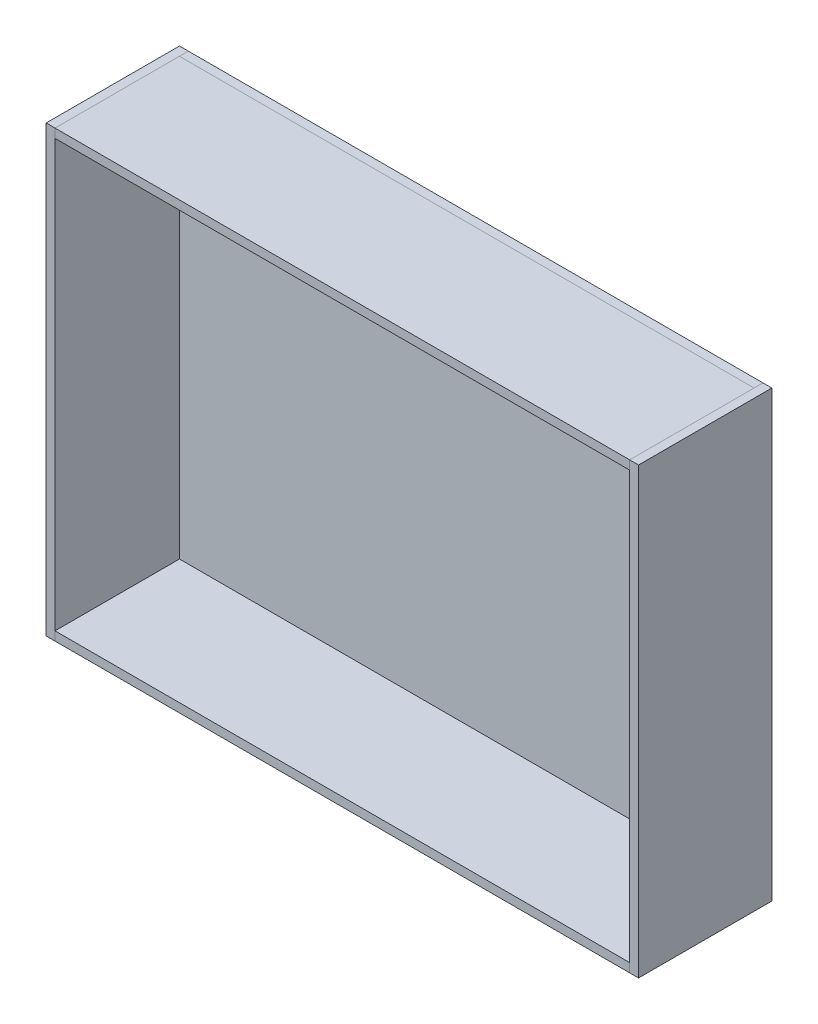
ISO-10303-21;
HEADER;
FILE_DESCRIPTION(('STEP AP214'),'2;1');
FILE_NAME('part.step','',(''),(''),'','','');
FILE_SCHEMA(('AUTOMOTIVE_DESIGN { 1 0 10303 214 1 1 1 1 }'));
ENDSEC;
DATA;
#1=APPLICATION_CONTEXT('core data for automotive mechanical design processes');
#2=APPLICATION_PROTOCOL_DEFINITION('international standard','automotive_design',2000,#1);
#3=PRODUCT_CONTEXT('',#1,'mechanical');
#4=PRODUCT('Part','Part','',(#3));
#5=PRODUCT_RELATED_PRODUCT_CATEGORY('part','',(#4));
#6=PRODUCT_DEFINITION_FORMATION('','',#4);
#7=PRODUCT_DEFINITION_CONTEXT('part definition',#1,'design');
#8=PRODUCT_DEFINITION('design','',#6,#7);
#9=PRODUCT_DEFINITION_SHAPE('','',#8);
#10=(LENGTH_UNIT() NAMED_UNIT(*) SI_UNIT(.MILLI.,.METRE.));
#11=(NAMED_UNIT(*) PLANE_ANGLE_UNIT() SI_UNIT($,.RADIAN.));
#12=(NAMED_UNIT(*) SI_UNIT($,.STERADIAN.) SOLID_ANGLE_UNIT());
#13=UNCERTAINTY_MEASURE_WITH_UNIT(LENGTH_MEASURE(1.E-05),#10,'distance_accuracy_value','');
#14=(GEOMETRIC_REPRESENTATION_CONTEXT(3) GLOBAL_UNCERTAINTY_ASSIGNED_CONTEXT((#13)) GLOBAL_UNIT_ASSIGNED_CONTEXT((#10,
#11,#12)) REPRESENTATION_CONTEXT('',''));
#15=CARTESIAN_POINT('',(0.,0.,0.));
#16=DIRECTION('',(0.,0.,1.));
#17=DIRECTION('',(1.,0.,0.));
#18=AXIS2_PLACEMENT_3D('',#15,#16,#17);
#19=CARTESIAN_POINT('',(97.,-75.,239.023194489731));
#20=DIRECTION('',(-1.,0.,0.));
#21=DIRECTION('',(0.,0.,1.));
#22=AXIS2_PLACEMENT_3D('',#19,#20,#21);
#23=PLANE('',#22);
#24=DIRECTION('',(0.,1.,0.));
#25=VECTOR('',#24,1.);
#26=CARTESIAN_POINT('',(97.,-75.,45.));
#27=LINE('',#26,#25);
#28=CARTESIAN_POINT('',(97.,-75.,45.));
#29=VERTEX_POINT('',#28);
#30=CARTESIAN_POINT('',(97.,-72.,45.));
#31=VERTEX_POINT('',#30);
#32=EDGE_CURVE('E93',#29,#31,#27,.T.);
#33=ORIENTED_EDGE('',*,*,#32,.F.);
#34=DIRECTION('',(0.,0.,-1.));
#35=VECTOR('',#34,1.);
#36=CARTESIAN_POINT('',(97.,-75.,239.023194489731));
#37=LINE('',#36,#35);
#38=CARTESIAN_POINT('',(97.,-75.,3.));
#39=VERTEX_POINT('',#38);
#40=EDGE_CURVE('E47',#29,#39,#37,.T.);
#41=ORIENTED_EDGE('',*,*,#40,.T.);
#42=DIRECTION('',(0.,1.,0.));
#43=VECTOR('',#42,1.);
#44=CARTESIAN_POINT('',(97.,-75.,3.));
#45=LINE('',#44,#43);
#46=CARTESIAN_POINT('',(97.,-72.,3.));
#47=VERTEX_POINT('',#46);
#48=EDGE_CURVE('E91',#39,#47,#45,.T.);
#49=ORIENTED_EDGE('',*,*,#48,.T.);
#50=DIRECTION('',(0.,0.,-1.));
#51=VECTOR('',#50,1.);
#52=CARTESIAN_POINT('',(97.,-72.,239.023194489731));
#53=LINE('',#52,#51);
#54=EDGE_CURVE('E82',#31,#47,#53,.T.);
#55=ORIENTED_EDGE('',*,*,#54,.F.);
#56=EDGE_LOOP('',(#33,#41,#49,#55));
#57=FACE_BOUND('',#56,.T.);
#58=ADVANCED_FACE('F43',(#57),#23,.F.);
#59=CARTESIAN_POINT('',(97.,-72.,239.023194489731));
#60=DIRECTION('',(0.,-1.,0.));
#61=DIRECTION('',(1.,0.,0.));
#62=AXIS2_PLACEMENT_3D('',#59,#60,#61);
#63=PLANE('',#62);
#64=DIRECTION('',(-1.,0.,0.));
#65=VECTOR('',#64,1.);
#66=CARTESIAN_POINT('',(97.,-72.,45.));
#67=LINE('',#66,#65);
#68=CARTESIAN_POINT('',(-97.,-72.,45.));
#69=VERTEX_POINT('',#68);
#70=EDGE_CURVE('E52',#31,#69,#67,.T.);
#71=ORIENTED_EDGE('',*,*,#70,.F.);
#72=ORIENTED_EDGE('',*,*,#54,.T.);
#73=DIRECTION('',(-1.,0.,0.));
#74=VECTOR('',#73,1.);
#75=CARTESIAN_POINT('',(97.,-72.,3.));
#76=LINE('',#75,#74);
#77=CARTESIAN_POINT('',(-97.,-72.,3.));
#78=VERTEX_POINT('',#77);
#79=EDGE_CURVE('E103',#47,#78,#76,.T.);
#80=ORIENTED_EDGE('',*,*,#79,.T.);
#81=DIRECTION('',(0.,0.,-1.));
#82=VECTOR('',#81,1.);
#83=CARTESIAN_POINT('',(-97.,-72.,239.023194489731));
#84=LINE('',#83,#82);
#85=EDGE_CURVE('E112',#69,#78,#84,.T.);
#86=ORIENTED_EDGE('',*,*,#85,.F.);
#87=EDGE_LOOP('',(#71,#72,#80,#86));
#88=FACE_BOUND('',#87,.T.);
#89=ADVANCED_FACE('F116',(#88),#63,.F.);
#90=CARTESIAN_POINT('',(-97.,-75.,239.023194489731));
#91=DIRECTION('',(1.,0.,0.));
#92=DIRECTION('',(0.,0.,-1.));
#93=AXIS2_PLACEMENT_3D('',#90,#91,#92);
#94=PLANE('',#93);
#95=DIRECTION('',(0.,-1.,0.));
#96=VECTOR('',#95,1.);
#97=CARTESIAN_POINT('',(-97.,-75.,45.));
#98=LINE('',#97,#96);
#99=CARTESIAN_POINT('',(-97.,-75.,45.));
#100=VERTEX_POINT('',#99);
#101=EDGE_CURVE('E12',#69,#100,#98,.T.);
#102=ORIENTED_EDGE('',*,*,#101,.F.);
#103=ORIENTED_EDGE('',*,*,#85,.T.);
#104=DIRECTION('',(0.,-1.,0.));
#105=VECTOR('',#104,1.);
#106=CARTESIAN_POINT('',(-97.,-75.,3.));
#107=LINE('',#106,#105);
#108=CARTESIAN_POINT('',(-97.,-75.,3.));
#109=VERTEX_POINT('',#108);
#110=EDGE_CURVE('E113',#78,#109,#107,.T.);
#111=ORIENTED_EDGE('',*,*,#110,.T.);
#112=DIRECTION('',(0.,0.,-1.));
#113=VECTOR('',#112,1.);
#114=CARTESIAN_POINT('',(-97.,-75.,239.023194489731));
#115=LINE('',#114,#113);
#116=EDGE_CURVE('E65',#100,#109,#115,.T.);
#117=ORIENTED_EDGE('',*,*,#116,.F.);
#118=EDGE_LOOP('',(#102,#103,#111,#117));
#119=FACE_BOUND('',#118,.T.);
#120=ADVANCED_FACE('F115',(#119),#94,.F.);
#121=CARTESIAN_POINT('',(97.,-75.,239.023194489731));
#122=DIRECTION('',(0.,1.,0.));
#123=DIRECTION('',(-1.,0.,0.));
#124=AXIS2_PLACEMENT_3D('',#121,#122,#123);
#125=PLANE('',#124);
#126=DIRECTION('',(1.,0.,0.));
#127=VECTOR('',#126,1.);
#128=CARTESIAN_POINT('',(97.,-75.,45.));
#129=LINE('',#128,#127);
#130=EDGE_CURVE('E100',#100,#29,#129,.T.);
#131=ORIENTED_EDGE('',*,*,#130,.F.);
#132=ORIENTED_EDGE('',*,*,#116,.T.);
#133=DIRECTION('',(1.,0.,0.));
#134=VECTOR('',#133,1.);
#135=CARTESIAN_POINT('',(97.,-75.,3.));
#136=LINE('',#135,#134);
#137=EDGE_CURVE('E96',#109,#39,#136,.T.);
#138=ORIENTED_EDGE('',*,*,#137,.T.);
#139=ORIENTED_EDGE('',*,*,#40,.F.);
#140=EDGE_LOOP('',(#131,#132,#138,#139));
#141=FACE_BOUND('',#140,.T.);
#142=ADVANCED_FACE('F97',(#141),#125,.F.);
#143=CARTESIAN_POINT('',(0.,0.,3.));
#144=DIRECTION('',(0.,0.,1.));
#145=DIRECTION('',(1.,0.,0.));
#146=AXIS2_PLACEMENT_3D('',#143,#144,#145);
#147=PLANE('',#146);
#148=ORIENTED_EDGE('',*,*,#48,.F.);
#149=ORIENTED_EDGE('',*,*,#137,.F.);
#150=ORIENTED_EDGE('',*,*,#110,.F.);
#151=ORIENTED_EDGE('',*,*,#79,.F.);
#152=EDGE_LOOP('',(#148,#149,#150,#151));
#153=FACE_BOUND('',#152,.T.);
#154=ADVANCED_FACE('F102',(#153),#147,.F.);
#155=CARTESIAN_POINT('',(97.,-120.099889135119,45.));
#156=DIRECTION('',(0.,0.,1.));
#157=DIRECTION('',(1.,0.,0.));
#158=AXIS2_PLACEMENT_3D('',#155,#156,#157);
#159=PLANE('',#158);
#160=ORIENTED_EDGE('',*,*,#130,.T.);
#161=ORIENTED_EDGE('',*,*,#32,.T.);
#162=ORIENTED_EDGE('',*,*,#70,.T.);
#163=ORIENTED_EDGE('',*,*,#101,.T.);
#164=EDGE_LOOP('',(#160,#161,#162,#163));
#165=FACE_BOUND('',#164,.T.);
#166=ADVANCED_FACE('F45',(#165),#159,.T.);
#167=CLOSED_SHELL('',(#58,#89,#120,#142,#154,#166));
#168=MANIFOLD_SOLID_BREP('B2',#167);
#169=CARTESIAN_POINT('',(-97.,75.,239.023194489731));
#170=DIRECTION('',(1.,0.,0.));
#171=DIRECTION('',(0.,0.,-1.));
#172=AXIS2_PLACEMENT_3D('',#169,#170,#171);
#173=PLANE('',#172);
#174=DIRECTION('',(0.,-1.,0.));
#175=VECTOR('',#174,1.);
#176=CARTESIAN_POINT('',(-97.,75.,45.));
#177=LINE('',#176,#175);
#178=CARTESIAN_POINT('',(-97.,75.,45.));
#179=VERTEX_POINT('',#178);
#180=CARTESIAN_POINT('',(-97.,72.,45.));
#181=VERTEX_POINT('',#180);
#182=EDGE_CURVE('E226',#179,#181,#177,.T.);
#183=ORIENTED_EDGE('',*,*,#182,.F.);
#184=DIRECTION('',(0.,0.,-1.));
#185=VECTOR('',#184,1.);
#186=CARTESIAN_POINT('',(-97.,75.,239.023194489731));
#187=LINE('',#186,#185);
#188=CARTESIAN_POINT('',(-97.,75.,3.));
#189=VERTEX_POINT('',#188);
#190=EDGE_CURVE('E180',#179,#189,#187,.T.);
#191=ORIENTED_EDGE('',*,*,#190,.T.);
#192=DIRECTION('',(0.,-1.,0.));
#193=VECTOR('',#192,1.);
#194=CARTESIAN_POINT('',(-97.,75.,3.));
#195=LINE('',#194,#193);
#196=CARTESIAN_POINT('',(-97.,72.,3.));
#197=VERTEX_POINT('',#196);
#198=EDGE_CURVE('E224',#189,#197,#195,.T.);
#199=ORIENTED_EDGE('',*,*,#198,.T.);
#200=DIRECTION('',(0.,0.,-1.));
#201=VECTOR('',#200,1.);
#202=CARTESIAN_POINT('',(-97.,72.,239.023194489731));
#203=LINE('',#202,#201);
#204=EDGE_CURVE('E215',#181,#197,#203,.T.);
#205=ORIENTED_EDGE('',*,*,#204,.F.);
#206=EDGE_LOOP('',(#183,#191,#199,#205));
#207=FACE_BOUND('',#206,.T.);
#208=ADVANCED_FACE('F176',(#207),#173,.F.);
#209=CARTESIAN_POINT('',(-97.,72.,239.023194489731));
#210=DIRECTION('',(0.,1.,0.));
#211=DIRECTION('',(-1.,0.,0.));
#212=AXIS2_PLACEMENT_3D('',#209,#210,#211);
#213=PLANE('',#212);
#214=DIRECTION('',(1.,0.,0.));
#215=VECTOR('',#214,1.);
#216=CARTESIAN_POINT('',(-97.,72.,45.));
#217=LINE('',#216,#215);
#218=CARTESIAN_POINT('',(97.,72.,45.));
#219=VERTEX_POINT('',#218);
#220=EDGE_CURVE('E185',#181,#219,#217,.T.);
#221=ORIENTED_EDGE('',*,*,#220,.F.);
#222=ORIENTED_EDGE('',*,*,#204,.T.);
#223=DIRECTION('',(1.,0.,0.));
#224=VECTOR('',#223,1.);
#225=CARTESIAN_POINT('',(-97.,72.,3.));
#226=LINE('',#225,#224);
#227=CARTESIAN_POINT('',(97.,72.,3.));
#228=VERTEX_POINT('',#227);
#229=EDGE_CURVE('E236',#197,#228,#226,.T.);
#230=ORIENTED_EDGE('',*,*,#229,.T.);
#231=DIRECTION('',(0.,0.,-1.));
#232=VECTOR('',#231,1.);
#233=CARTESIAN_POINT('',(97.,72.,239.023194489731));
#234=LINE('',#233,#232);
#235=EDGE_CURVE('E245',#219,#228,#234,.T.);
#236=ORIENTED_EDGE('',*,*,#235,.F.);
#237=EDGE_LOOP('',(#221,#222,#230,#236));
#238=FACE_BOUND('',#237,.T.);
#239=ADVANCED_FACE('F249',(#238),#213,.F.);
#240=CARTESIAN_POINT('',(97.,75.,239.023194489731));
#241=DIRECTION('',(-1.,0.,0.));
#242=DIRECTION('',(0.,0.,1.));
#243=AXIS2_PLACEMENT_3D('',#240,#241,#242);
#244=PLANE('',#243);
#245=DIRECTION('',(0.,1.,0.));
#246=VECTOR('',#245,1.);
#247=CARTESIAN_POINT('',(97.,75.,45.));
#248=LINE('',#247,#246);
#249=CARTESIAN_POINT('',(97.,75.,45.));
#250=VERTEX_POINT('',#249);
#251=EDGE_CURVE('E41',#219,#250,#248,.T.);
#252=ORIENTED_EDGE('',*,*,#251,.F.);
#253=ORIENTED_EDGE('',*,*,#235,.T.);
#254=DIRECTION('',(0.,1.,0.));
#255=VECTOR('',#254,1.);
#256=CARTESIAN_POINT('',(97.,75.,3.));
#257=LINE('',#256,#255);
#258=CARTESIAN_POINT('',(97.,75.,3.));
#259=VERTEX_POINT('',#258);
#260=EDGE_CURVE('E246',#228,#259,#257,.T.);
#261=ORIENTED_EDGE('',*,*,#260,.T.);
#262=DIRECTION('',(0.,0.,-1.));
#263=VECTOR('',#262,1.);
#264=CARTESIAN_POINT('',(97.,75.,239.023194489731));
#265=LINE('',#264,#263);
#266=EDGE_CURVE('E198',#250,#259,#265,.T.);
#267=ORIENTED_EDGE('',*,*,#266,.F.);
#268=EDGE_LOOP('',(#252,#253,#261,#267));
#269=FACE_BOUND('',#268,.T.);
#270=ADVANCED_FACE('F248',(#269),#244,.F.);
#271=CARTESIAN_POINT('',(-97.,75.,239.023194489731));
#272=DIRECTION('',(0.,-1.,0.));
#273=DIRECTION('',(0.,0.,-1.));
#274=AXIS2_PLACEMENT_3D('',#271,#272,#273);
#275=PLANE('',#274);
#276=DIRECTION('',(-1.,0.,0.));
#277=VECTOR('',#276,1.);
#278=CARTESIAN_POINT('',(-97.,75.,45.));
#279=LINE('',#278,#277);
#280=EDGE_CURVE('E233',#250,#179,#279,.T.);
#281=ORIENTED_EDGE('',*,*,#280,.F.);
#282=ORIENTED_EDGE('',*,*,#266,.T.);
#283=DIRECTION('',(-1.,0.,0.));
#284=VECTOR('',#283,1.);
#285=CARTESIAN_POINT('',(-97.,75.,3.));
#286=LINE('',#285,#284);
#287=EDGE_CURVE('E229',#259,#189,#286,.T.);
#288=ORIENTED_EDGE('',*,*,#287,.T.);
#289=ORIENTED_EDGE('',*,*,#190,.F.);
#290=EDGE_LOOP('',(#281,#282,#288,#289));
#291=FACE_BOUND('',#290,.T.);
#292=ADVANCED_FACE('F230',(#291),#275,.F.);
#293=CARTESIAN_POINT('',(0.,0.,3.));
#294=DIRECTION('',(0.,0.,1.));
#295=DIRECTION('',(1.,0.,0.));
#296=AXIS2_PLACEMENT_3D('',#293,#294,#295);
#297=PLANE('',#296);
#298=ORIENTED_EDGE('',*,*,#198,.F.);
#299=ORIENTED_EDGE('',*,*,#287,.F.);
#300=ORIENTED_EDGE('',*,*,#260,.F.);
#301=ORIENTED_EDGE('',*,*,#229,.F.);
#302=EDGE_LOOP('',(#298,#299,#300,#301));
#303=FACE_BOUND('',#302,.T.);
#304=ADVANCED_FACE('F235',(#303),#297,.F.);
#305=CARTESIAN_POINT('',(97.,-120.099889135119,45.));
#306=DIRECTION('',(0.,0.,1.));
#307=DIRECTION('',(1.,0.,0.));
#308=AXIS2_PLACEMENT_3D('',#305,#306,#307);
#309=PLANE('',#308);
#310=ORIENTED_EDGE('',*,*,#280,.T.);
#311=ORIENTED_EDGE('',*,*,#182,.T.);
#312=ORIENTED_EDGE('',*,*,#220,.T.);
#313=ORIENTED_EDGE('',*,*,#251,.T.);
#314=EDGE_LOOP('',(#310,#311,#312,#313));
#315=FACE_BOUND('',#314,.T.);
#316=ADVANCED_FACE('F178',(#315),#309,.T.);
#317=CLOSED_SHELL('',(#208,#239,#270,#292,#304,#316));
#318=MANIFOLD_SOLID_BREP('B6',#317);
#319=CARTESIAN_POINT('',(97.,-120.099889135119,0.));
#320=DIRECTION('',(-1.,0.,0.));
#321=DIRECTION('',(0.,-1.,0.));
#322=AXIS2_PLACEMENT_3D('',#319,#320,#321);
#323=PLANE('',#322);
#324=DIRECTION('',(0.,0.,-1.));
#325=VECTOR('',#324,1.);
#326=CARTESIAN_POINT('',(97.,-75.,0.));
#327=LINE('',#326,#325);
#328=CARTESIAN_POINT('',(97.,-75.,45.));
#329=VERTEX_POINT('',#328);
#330=CARTESIAN_POINT('',(97.,-75.,0.));
#331=VERTEX_POINT('',#330);
#332=EDGE_CURVE('E317',#329,#331,#327,.T.);
#333=ORIENTED_EDGE('',*,*,#332,.F.);
#334=DIRECTION('',(0.,1.,0.));
#335=VECTOR('',#334,1.);
#336=CARTESIAN_POINT('',(97.,-120.099889135119,45.));
#337=LINE('',#336,#335);
#338=CARTESIAN_POINT('',(97.,75.,45.));
#339=VERTEX_POINT('',#338);
#340=EDGE_CURVE('E345',#329,#339,#337,.T.);
#341=ORIENTED_EDGE('',*,*,#340,.T.);
#342=DIRECTION('',(0.,0.,1.));
#343=VECTOR('',#342,1.);
#344=CARTESIAN_POINT('',(97.,75.,0.));
#345=LINE('',#344,#343);
#346=CARTESIAN_POINT('',(97.,75.,0.));
#347=VERTEX_POINT('',#346);
#348=EDGE_CURVE('E349',#347,#339,#345,.T.);
#349=ORIENTED_EDGE('',*,*,#348,.F.);
#350=DIRECTION('',(0.,1.,0.));
#351=VECTOR('',#350,1.);
#352=CARTESIAN_POINT('',(97.,-120.099889135119,0.));
#353=LINE('',#352,#351);
#354=EDGE_CURVE('E372',#331,#347,#353,.T.);
#355=ORIENTED_EDGE('',*,*,#354,.F.);
#356=EDGE_LOOP('',(#333,#341,#349,#355));
#357=FACE_BOUND('',#356,.T.);
#358=ADVANCED_FACE('F309',(#357),#323,.T.);
#359=CARTESIAN_POINT('',(97.,-120.099889135119,0.));
#360=DIRECTION('',(0.,0.,-1.));
#361=DIRECTION('',(-1.,0.,0.));
#362=AXIS2_PLACEMENT_3D('',#359,#360,#361);
#363=PLANE('',#362);
#364=DIRECTION('',(1.,0.,0.));
#365=VECTOR('',#364,1.);
#366=CARTESIAN_POINT('',(97.,-75.,0.));
#367=LINE('',#366,#365);
#368=CARTESIAN_POINT('',(100.,-75.,0.));
#369=VERTEX_POINT('',#368);
#370=EDGE_CURVE('E323',#331,#369,#367,.T.);
#371=ORIENTED_EDGE('',*,*,#370,.F.);
#372=ORIENTED_EDGE('',*,*,#354,.T.);
#373=DIRECTION('',(-1.,0.,0.));
#374=VECTOR('',#373,1.);
#375=CARTESIAN_POINT('',(97.,75.,0.));
#376=LINE('',#375,#374);
#377=CARTESIAN_POINT('',(100.,75.,0.));
#378=VERTEX_POINT('',#377);
#379=EDGE_CURVE('E354',#378,#347,#376,.T.);
#380=ORIENTED_EDGE('',*,*,#379,.F.);
#381=DIRECTION('',(0.,1.,0.));
#382=VECTOR('',#381,1.);
#383=CARTESIAN_POINT('',(100.,-120.099889135119,0.));
#384=LINE('',#383,#382);
#385=EDGE_CURVE('E375',#369,#378,#384,.T.);
#386=ORIENTED_EDGE('',*,*,#385,.F.);
#387=EDGE_LOOP('',(#371,#372,#380,#386));
#388=FACE_BOUND('',#387,.T.);
#389=ADVANCED_FACE('F381',(#388),#363,.T.);
#390=CARTESIAN_POINT('',(100.,-120.099889135119,0.));
#391=DIRECTION('',(1.,0.,0.));
#392=DIRECTION('',(0.,1.,0.));
#393=AXIS2_PLACEMENT_3D('',#390,#391,#392);
#394=PLANE('',#393);
#395=DIRECTION('',(0.,0.,1.));
#396=VECTOR('',#395,1.);
#397=CARTESIAN_POINT('',(100.,-75.,0.));
#398=LINE('',#397,#396);
#399=CARTESIAN_POINT('',(100.,-75.,45.));
#400=VERTEX_POINT('',#399);
#401=EDGE_CURVE('E374',#369,#400,#398,.T.);
#402=ORIENTED_EDGE('',*,*,#401,.F.);
#403=ORIENTED_EDGE('',*,*,#385,.T.);
#404=DIRECTION('',(0.,0.,-1.));
#405=VECTOR('',#404,1.);
#406=CARTESIAN_POINT('',(100.,75.,0.));
#407=LINE('',#406,#405);
#408=CARTESIAN_POINT('',(100.,75.,45.));
#409=VERTEX_POINT('',#408);
#410=EDGE_CURVE('E362',#409,#378,#407,.T.);
#411=ORIENTED_EDGE('',*,*,#410,.F.);
#412=DIRECTION('',(0.,1.,0.));
#413=VECTOR('',#412,1.);
#414=CARTESIAN_POINT('',(100.,-120.099889135119,45.));
#415=LINE('',#414,#413);
#416=EDGE_CURVE('E353',#400,#409,#415,.T.);
#417=ORIENTED_EDGE('',*,*,#416,.F.);
#418=EDGE_LOOP('',(#402,#403,#411,#417));
#419=FACE_BOUND('',#418,.T.);
#420=ADVANCED_FACE('F379',(#419),#394,.T.);
#421=CARTESIAN_POINT('',(97.,-120.099889135119,45.));
#422=DIRECTION('',(0.,0.,1.));
#423=DIRECTION('',(1.,0.,0.));
#424=AXIS2_PLACEMENT_3D('',#421,#422,#423);
#425=PLANE('',#424);
#426=DIRECTION('',(-1.,0.,0.));
#427=VECTOR('',#426,1.);
#428=CARTESIAN_POINT('',(97.,-75.,45.));
#429=LINE('',#428,#427);
#430=EDGE_CURVE('E174',#400,#329,#429,.T.);
#431=ORIENTED_EDGE('',*,*,#430,.F.);
#432=ORIENTED_EDGE('',*,*,#416,.T.);
#433=DIRECTION('',(1.,0.,0.));
#434=VECTOR('',#433,1.);
#435=CARTESIAN_POINT('',(97.,75.,45.));
#436=LINE('',#435,#434);
#437=EDGE_CURVE('E356',#339,#409,#436,.T.);
#438=ORIENTED_EDGE('',*,*,#437,.F.);
#439=ORIENTED_EDGE('',*,*,#340,.F.);
#440=EDGE_LOOP('',(#431,#432,#438,#439));
#441=FACE_BOUND('',#440,.T.);
#442=ADVANCED_FACE('F357',(#441),#425,.T.);
#443=CARTESIAN_POINT('',(0.,75.,0.));
#444=DIRECTION('',(0.,1.,0.));
#445=DIRECTION('',(0.,0.,1.));
#446=AXIS2_PLACEMENT_3D('',#443,#444,#445);
#447=PLANE('',#446);
#448=ORIENTED_EDGE('',*,*,#348,.T.);
#449=ORIENTED_EDGE('',*,*,#437,.T.);
#450=ORIENTED_EDGE('',*,*,#410,.T.);
#451=ORIENTED_EDGE('',*,*,#379,.T.);
#452=EDGE_LOOP('',(#448,#449,#450,#451));
#453=FACE_BOUND('',#452,.T.);
#454=ADVANCED_FACE('F364',(#453),#447,.T.);
#455=CARTESIAN_POINT('',(97.,-75.,3.));
#456=DIRECTION('',(0.,1.,0.));
#457=DIRECTION('',(-1.,0.,0.));
#458=AXIS2_PLACEMENT_3D('',#455,#456,#457);
#459=PLANE('',#458);
#460=ORIENTED_EDGE('',*,*,#332,.T.);
#461=ORIENTED_EDGE('',*,*,#370,.T.);
#462=ORIENTED_EDGE('',*,*,#401,.T.);
#463=ORIENTED_EDGE('',*,*,#430,.T.);
#464=EDGE_LOOP('',(#460,#461,#462,#463));
#465=FACE_BOUND('',#464,.T.);
#466=ADVANCED_FACE('F383',(#465),#459,.F.);
#467=CLOSED_SHELL('',(#358,#389,#420,#442,#454,#466));
#468=MANIFOLD_SOLID_BREP('B35',#467);
#469=CARTESIAN_POINT('',(-97.,-120.099889135119,0.));
#470=DIRECTION('',(1.,0.,0.));
#471=DIRECTION('',(0.,1.,0.));
#472=AXIS2_PLACEMENT_3D('',#469,#470,#471);
#473=PLANE('',#472);
#474=DIRECTION('',(0.,0.,1.));
#475=VECTOR('',#474,1.);
#476=CARTESIAN_POINT('',(-97.,-75.,0.));
#477=LINE('',#476,#475);
#478=CARTESIAN_POINT('',(-97.,-75.,0.));
#479=VERTEX_POINT('',#478);
#480=CARTESIAN_POINT('',(-97.,-75.,45.));
#481=VERTEX_POINT('',#480);
#482=EDGE_CURVE('E449',#479,#481,#477,.T.);
#483=ORIENTED_EDGE('',*,*,#482,.F.);
#484=DIRECTION('',(0.,1.,0.));
#485=VECTOR('',#484,1.);
#486=CARTESIAN_POINT('',(-97.,-120.099889135119,0.));
#487=LINE('',#486,#485);
#488=CARTESIAN_POINT('',(-97.,75.,0.));
#489=VERTEX_POINT('',#488);
#490=EDGE_CURVE('E477',#479,#489,#487,.T.);
#491=ORIENTED_EDGE('',*,*,#490,.T.);
#492=DIRECTION('',(0.,0.,-1.));
#493=VECTOR('',#492,1.);
#494=CARTESIAN_POINT('',(-97.,75.,0.));
#495=LINE('',#494,#493);
#496=CARTESIAN_POINT('',(-97.,75.,45.));
#497=VERTEX_POINT('',#496);
#498=EDGE_CURVE('E481',#497,#489,#495,.T.);
#499=ORIENTED_EDGE('',*,*,#498,.F.);
#500=DIRECTION('',(0.,1.,0.));
#501=VECTOR('',#500,1.);
#502=CARTESIAN_POINT('',(-97.,-120.099889135119,45.));
#503=LINE('',#502,#501);
#504=EDGE_CURVE('E504',#481,#497,#503,.T.);
#505=ORIENTED_EDGE('',*,*,#504,.F.);
#506=EDGE_LOOP('',(#483,#491,#499,#505));
#507=FACE_BOUND('',#506,.T.);
#508=ADVANCED_FACE('F441',(#507),#473,.T.);
#509=CARTESIAN_POINT('',(-97.,-120.099889135119,45.));
#510=DIRECTION('',(0.,0.,1.));
#511=DIRECTION('',(1.,0.,0.));
#512=AXIS2_PLACEMENT_3D('',#509,#510,#511);
#513=PLANE('',#512);
#514=DIRECTION('',(-1.,0.,0.));
#515=VECTOR('',#514,1.);
#516=CARTESIAN_POINT('',(-97.,-75.,45.));
#517=LINE('',#516,#515);
#518=CARTESIAN_POINT('',(-100.,-75.,45.));
#519=VERTEX_POINT('',#518);
#520=EDGE_CURVE('E455',#481,#519,#517,.T.);
#521=ORIENTED_EDGE('',*,*,#520,.F.);
#522=ORIENTED_EDGE('',*,*,#504,.T.);
#523=DIRECTION('',(1.,0.,0.));
#524=VECTOR('',#523,1.);
#525=CARTESIAN_POINT('',(-97.,75.,45.));
#526=LINE('',#525,#524);
#527=CARTESIAN_POINT('',(-100.,75.,45.));
#528=VERTEX_POINT('',#527);
#529=EDGE_CURVE('E486',#528,#497,#526,.T.);
#530=ORIENTED_EDGE('',*,*,#529,.F.);
#531=DIRECTION('',(0.,1.,0.));
#532=VECTOR('',#531,1.);
#533=CARTESIAN_POINT('',(-100.,-120.099889135119,45.));
#534=LINE('',#533,#532);
#535=EDGE_CURVE('E507',#519,#528,#534,.T.);
#536=ORIENTED_EDGE('',*,*,#535,.F.);
#537=EDGE_LOOP('',(#521,#522,#530,#536));
#538=FACE_BOUND('',#537,.T.);
#539=ADVANCED_FACE('F513',(#538),#513,.T.);
#540=CARTESIAN_POINT('',(-100.,-120.099889135119,0.));
#541=DIRECTION('',(-1.,0.,0.));
#542=DIRECTION('',(0.,-1.,0.));
#543=AXIS2_PLACEMENT_3D('',#540,#541,#542);
#544=PLANE('',#543);
#545=DIRECTION('',(0.,0.,-1.));
#546=VECTOR('',#545,1.);
#547=CARTESIAN_POINT('',(-100.,-75.,0.));
#548=LINE('',#547,#546);
#549=CARTESIAN_POINT('',(-100.,-75.,0.));
#550=VERTEX_POINT('',#549);
#551=EDGE_CURVE('E506',#519,#550,#548,.T.);
#552=ORIENTED_EDGE('',*,*,#551,.F.);
#553=ORIENTED_EDGE('',*,*,#535,.T.);
#554=DIRECTION('',(0.,0.,1.));
#555=VECTOR('',#554,1.);
#556=CARTESIAN_POINT('',(-100.,75.,0.));
#557=LINE('',#556,#555);
#558=CARTESIAN_POINT('',(-100.,75.,0.));
#559=VERTEX_POINT('',#558);
#560=EDGE_CURVE('E494',#559,#528,#557,.T.);
#561=ORIENTED_EDGE('',*,*,#560,.F.);
#562=DIRECTION('',(0.,1.,0.));
#563=VECTOR('',#562,1.);
#564=CARTESIAN_POINT('',(-100.,-120.099889135119,0.));
#565=LINE('',#564,#563);
#566=EDGE_CURVE('E485',#550,#559,#565,.T.);
#567=ORIENTED_EDGE('',*,*,#566,.F.);
#568=EDGE_LOOP('',(#552,#553,#561,#567));
#569=FACE_BOUND('',#568,.T.);
#570=ADVANCED_FACE('F511',(#569),#544,.T.);
#571=CARTESIAN_POINT('',(-97.,-120.099889135119,0.));
#572=DIRECTION('',(0.,0.,-1.));
#573=DIRECTION('',(-1.,0.,0.));
#574=AXIS2_PLACEMENT_3D('',#571,#572,#573);
#575=PLANE('',#574);
#576=DIRECTION('',(1.,0.,0.));
#577=VECTOR('',#576,1.);
#578=CARTESIAN_POINT('',(-97.,-75.,0.));
#579=LINE('',#578,#577);
#580=EDGE_CURVE('E307',#550,#479,#579,.T.);
#581=ORIENTED_EDGE('',*,*,#580,.F.);
#582=ORIENTED_EDGE('',*,*,#566,.T.);
#583=DIRECTION('',(-1.,0.,0.));
#584=VECTOR('',#583,1.);
#585=CARTESIAN_POINT('',(-97.,75.,0.));
#586=LINE('',#585,#584);
#587=EDGE_CURVE('E488',#489,#559,#586,.T.);
#588=ORIENTED_EDGE('',*,*,#587,.F.);
#589=ORIENTED_EDGE('',*,*,#490,.F.);
#590=EDGE_LOOP('',(#581,#582,#588,#589));
#591=FACE_BOUND('',#590,.T.);
#592=ADVANCED_FACE('F489',(#591),#575,.T.);
#593=CARTESIAN_POINT('',(0.,75.,0.));
#594=DIRECTION('',(0.,-1.,0.));
#595=DIRECTION('',(0.,0.,-1.));
#596=AXIS2_PLACEMENT_3D('',#593,#594,#595);
#597=PLANE('',#596);
#598=ORIENTED_EDGE('',*,*,#498,.T.);
#599=ORIENTED_EDGE('',*,*,#587,.T.);
#600=ORIENTED_EDGE('',*,*,#560,.T.);
#601=ORIENTED_EDGE('',*,*,#529,.T.);
#602=EDGE_LOOP('',(#598,#599,#600,#601));
#603=FACE_BOUND('',#602,.T.);
#604=ADVANCED_FACE('F496',(#603),#597,.F.);
#605=CARTESIAN_POINT('',(97.,-75.,3.));
#606=DIRECTION('',(0.,1.,0.));
#607=DIRECTION('',(-1.,0.,0.));
#608=AXIS2_PLACEMENT_3D('',#605,#606,#607);
#609=PLANE('',#608);
#610=ORIENTED_EDGE('',*,*,#482,.T.);
#611=ORIENTED_EDGE('',*,*,#520,.T.);
#612=ORIENTED_EDGE('',*,*,#551,.T.);
#613=ORIENTED_EDGE('',*,*,#580,.T.);
#614=EDGE_LOOP('',(#610,#611,#612,#613));
#615=FACE_BOUND('',#614,.T.);
#616=ADVANCED_FACE('F515',(#615),#609,.F.);
#617=CLOSED_SHELL('',(#508,#539,#570,#592,#604,#616));
#618=MANIFOLD_SOLID_BREP('B168',#617);
#619=CARTESIAN_POINT('',(-97.,-75.,3.));
#620=DIRECTION('',(1.,0.,0.));
#621=DIRECTION('',(0.,0.,-1.));
#622=AXIS2_PLACEMENT_3D('',#619,#620,#621);
#623=PLANE('',#622);
#624=DIRECTION('',(0.,-1.,0.));
#625=VECTOR('',#624,1.);
#626=CARTESIAN_POINT('',(-97.,-75.,0.));
#627=LINE('',#626,#625);
#628=CARTESIAN_POINT('',(-97.,75.,0.));
#629=VERTEX_POINT('',#628);
#630=CARTESIAN_POINT('',(-97.,-75.,0.));
#631=VERTEX_POINT('',#630);
#632=EDGE_CURVE('E627',#629,#631,#627,.T.);
#633=ORIENTED_EDGE('',*,*,#632,.T.);
#634=DIRECTION('',(0.,0.,-1.));
#635=VECTOR('',#634,1.);
#636=CARTESIAN_POINT('',(-97.,-75.,3.));
#637=LINE('',#636,#635);
#638=CARTESIAN_POINT('',(-97.,-75.,3.));
#639=VERTEX_POINT('',#638);
#640=EDGE_CURVE('E439',#639,#631,#637,.T.);
#641=ORIENTED_EDGE('',*,*,#640,.F.);
#642=DIRECTION('',(0.,-1.,0.));
#643=VECTOR('',#642,1.);
#644=CARTESIAN_POINT('',(-97.,-75.,3.));
#645=LINE('',#644,#643);
#646=CARTESIAN_POINT('',(-97.,75.,3.));
#647=VERTEX_POINT('',#646);
#648=EDGE_CURVE('E615',#647,#639,#645,.T.);
#649=ORIENTED_EDGE('',*,*,#648,.F.);
#650=DIRECTION('',(0.,0.,-1.));
#651=VECTOR('',#650,1.);
#652=CARTESIAN_POINT('',(-97.,75.,3.));
#653=LINE('',#652,#651);
#654=EDGE_CURVE('E623',#647,#629,#653,.T.);
#655=ORIENTED_EDGE('',*,*,#654,.T.);
#656=EDGE_LOOP('',(#633,#641,#649,#655));
#657=FACE_BOUND('',#656,.T.);
#658=ADVANCED_FACE('F564',(#657),#623,.F.);
#659=CARTESIAN_POINT('',(97.,-75.,3.));
#660=DIRECTION('',(0.,1.,0.));
#661=DIRECTION('',(-1.,0.,0.));
#662=AXIS2_PLACEMENT_3D('',#659,#660,#661);
#663=PLANE('',#662);
#664=DIRECTION('',(1.,0.,0.));
#665=VECTOR('',#664,1.);
#666=CARTESIAN_POINT('',(97.,-75.,0.));
#667=LINE('',#666,#665);
#668=CARTESIAN_POINT('',(97.,-75.,0.));
#669=VERTEX_POINT('',#668);
#670=EDGE_CURVE('E619',#631,#669,#667,.T.);
#671=ORIENTED_EDGE('',*,*,#670,.T.);
#672=DIRECTION('',(0.,0.,-1.));
#673=VECTOR('',#672,1.);
#674=CARTESIAN_POINT('',(97.,-75.,3.));
#675=LINE('',#674,#673);
#676=CARTESIAN_POINT('',(97.,-75.,3.));
#677=VERTEX_POINT('',#676);
#678=EDGE_CURVE('E572',#677,#669,#675,.T.);
#679=ORIENTED_EDGE('',*,*,#678,.F.);
#680=DIRECTION('',(1.,0.,0.));
#681=VECTOR('',#680,1.);
#682=CARTESIAN_POINT('',(97.,-75.,3.));
#683=LINE('',#682,#681);
#684=EDGE_CURVE('E610',#639,#677,#683,.T.);
#685=ORIENTED_EDGE('',*,*,#684,.F.);
#686=ORIENTED_EDGE('',*,*,#640,.T.);
#687=EDGE_LOOP('',(#671,#679,#685,#686));
#688=FACE_BOUND('',#687,.T.);
#689=ADVANCED_FACE('F618',(#688),#663,.F.);
#690=CARTESIAN_POINT('',(97.,-75.,3.));
#691=DIRECTION('',(-1.,0.,0.));
#692=DIRECTION('',(0.,0.,1.));
#693=AXIS2_PLACEMENT_3D('',#690,#691,#692);
#694=PLANE('',#693);
#695=DIRECTION('',(0.,1.,0.));
#696=VECTOR('',#695,1.);
#697=CARTESIAN_POINT('',(97.,-75.,0.));
#698=LINE('',#697,#696);
#699=CARTESIAN_POINT('',(97.,75.,0.));
#700=VERTEX_POINT('',#699);
#701=EDGE_CURVE('E597',#669,#700,#698,.T.);
#702=ORIENTED_EDGE('',*,*,#701,.T.);
#703=DIRECTION('',(0.,0.,-1.));
#704=VECTOR('',#703,1.);
#705=CARTESIAN_POINT('',(97.,75.,3.));
#706=LINE('',#705,#704);
#707=CARTESIAN_POINT('',(97.,75.,3.));
#708=VERTEX_POINT('',#707);
#709=EDGE_CURVE('E620',#708,#700,#706,.T.);
#710=ORIENTED_EDGE('',*,*,#709,.F.);
#711=DIRECTION('',(0.,1.,0.));
#712=VECTOR('',#711,1.);
#713=CARTESIAN_POINT('',(97.,-75.,3.));
#714=LINE('',#713,#712);
#715=EDGE_CURVE('E613',#677,#708,#714,.T.);
#716=ORIENTED_EDGE('',*,*,#715,.F.);
#717=ORIENTED_EDGE('',*,*,#678,.T.);
#718=EDGE_LOOP('',(#702,#710,#716,#717));
#719=FACE_BOUND('',#718,.T.);
#720=ADVANCED_FACE('F621',(#719),#694,.F.);
#721=CARTESIAN_POINT('',(97.,75.,3.));
#722=DIRECTION('',(0.,-1.,0.));
#723=DIRECTION('',(1.,0.,0.));
#724=AXIS2_PLACEMENT_3D('',#721,#722,#723);
#725=PLANE('',#724);
#726=DIRECTION('',(-1.,0.,0.));
#727=VECTOR('',#726,1.);
#728=CARTESIAN_POINT('',(97.,75.,0.));
#729=LINE('',#728,#727);
#730=EDGE_CURVE('E603',#700,#629,#729,.T.);
#731=ORIENTED_EDGE('',*,*,#730,.T.);
#732=ORIENTED_EDGE('',*,*,#654,.F.);
#733=DIRECTION('',(-1.,0.,0.));
#734=VECTOR('',#733,1.);
#735=CARTESIAN_POINT('',(97.,75.,3.));
#736=LINE('',#735,#734);
#737=EDGE_CURVE('E580',#708,#647,#736,.T.);
#738=ORIENTED_EDGE('',*,*,#737,.F.);
#739=ORIENTED_EDGE('',*,*,#709,.T.);
#740=EDGE_LOOP('',(#731,#732,#738,#739));
#741=FACE_BOUND('',#740,.T.);
#742=ADVANCED_FACE('F634',(#741),#725,.F.);
#743=CARTESIAN_POINT('',(0.,0.,3.));
#744=DIRECTION('',(0.,0.,1.));
#745=DIRECTION('',(1.,0.,0.));
#746=AXIS2_PLACEMENT_3D('',#743,#744,#745);
#747=PLANE('',#746);
#748=ORIENTED_EDGE('',*,*,#648,.T.);
#749=ORIENTED_EDGE('',*,*,#684,.T.);
#750=ORIENTED_EDGE('',*,*,#715,.T.);
#751=ORIENTED_EDGE('',*,*,#737,.T.);
#752=EDGE_LOOP('',(#748,#749,#750,#751));
#753=FACE_BOUND('',#752,.T.);
#754=ADVANCED_FACE('F611',(#753),#747,.T.);
#755=CARTESIAN_POINT('',(0.,0.,0.));
#756=DIRECTION('',(0.,0.,1.));
#757=DIRECTION('',(1.,0.,0.));
#758=AXIS2_PLACEMENT_3D('',#755,#756,#757);
#759=PLANE('',#758);
#760=ORIENTED_EDGE('',*,*,#632,.F.);
#761=ORIENTED_EDGE('',*,*,#730,.F.);
#762=ORIENTED_EDGE('',*,*,#701,.F.);
#763=ORIENTED_EDGE('',*,*,#670,.F.);
#764=EDGE_LOOP('',(#760,#761,#762,#763));
#765=FACE_BOUND('',#764,.T.);
#766=ADVANCED_FACE('F637',(#765),#759,.F.);
#767=CLOSED_SHELL('',(#658,#689,#720,#742,#754,#766));
#768=MANIFOLD_SOLID_BREP('B301',#767);
#769=ADVANCED_BREP_SHAPE_REPRESENTATION('',(#18,#168,#318,#468,#618,#768),#14);
#770=SHAPE_DEFINITION_REPRESENTATION(#9,#769);
ENDSEC;
END-ISO-10303-21;
